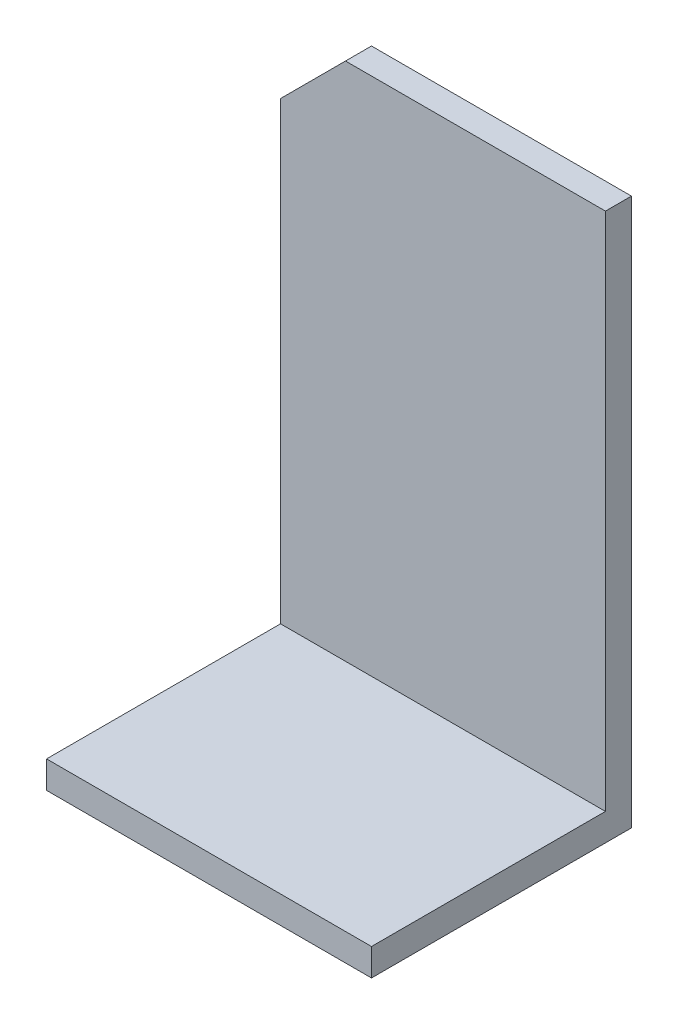
ISO-10303-21;
HEADER;
FILE_DESCRIPTION(('STEP AP214'),'2;1');
FILE_NAME('part.step','',(''),(''),'','','');
FILE_SCHEMA(('AUTOMOTIVE_DESIGN { 1 0 10303 214 1 1 1 1 }'));
ENDSEC;
DATA;
#1=APPLICATION_CONTEXT('core data for automotive mechanical design processes');
#2=APPLICATION_PROTOCOL_DEFINITION('international standard','automotive_design',2000,#1);
#3=PRODUCT_CONTEXT('',#1,'mechanical');
#4=PRODUCT('Part','Part','',(#3));
#5=PRODUCT_RELATED_PRODUCT_CATEGORY('part','',(#4));
#6=PRODUCT_DEFINITION_FORMATION('','',#4);
#7=PRODUCT_DEFINITION_CONTEXT('part definition',#1,'design');
#8=PRODUCT_DEFINITION('design','',#6,#7);
#9=PRODUCT_DEFINITION_SHAPE('','',#8);
#10=(LENGTH_UNIT() NAMED_UNIT(*) SI_UNIT(.MILLI.,.METRE.));
#11=(NAMED_UNIT(*) PLANE_ANGLE_UNIT() SI_UNIT($,.RADIAN.));
#12=(NAMED_UNIT(*) SI_UNIT($,.STERADIAN.) SOLID_ANGLE_UNIT());
#13=UNCERTAINTY_MEASURE_WITH_UNIT(LENGTH_MEASURE(1.E-05),#10,'distance_accuracy_value','');
#14=(GEOMETRIC_REPRESENTATION_CONTEXT(3) GLOBAL_UNCERTAINTY_ASSIGNED_CONTEXT((#13)) GLOBAL_UNIT_ASSIGNED_CONTEXT((#10,
#11,#12)) REPRESENTATION_CONTEXT('',''));
#15=CARTESIAN_POINT('',(0.,0.,0.));
#16=DIRECTION('',(0.,0.,1.));
#17=DIRECTION('',(1.,0.,0.));
#18=AXIS2_PLACEMENT_3D('',#15,#16,#17);
#19=CARTESIAN_POINT('',(-0.778320699595434,-1.5105,0.2));
#20=DIRECTION('',(0.,0.,1.));
#21=DIRECTION('',(0.,-1.,0.));
#22=AXIS2_PLACEMENT_3D('',#19,#20,#21);
#23=PLANE('',#22);
#24=DIRECTION('',(1.,0.,0.));
#25=VECTOR('',#24,1.);
#26=CARTESIAN_POINT('',(-0.778320699595434,-1.521,0.2));
#27=LINE('',#26,#25);
#28=CARTESIAN_POINT('',(-0.903320699595434,-1.521,0.2));
#29=VERTEX_POINT('',#28);
#30=CARTESIAN_POINT('',(-0.653320699595434,-1.521,0.2));
#31=VERTEX_POINT('',#30);
#32=EDGE_CURVE('E78',#29,#31,#27,.T.);
#33=ORIENTED_EDGE('',*,*,#32,.T.);
#34=DIRECTION('',(0.,-1.,0.));
#35=VECTOR('',#34,1.);
#36=CARTESIAN_POINT('',(-0.653320699595434,-1.36847101449276,0.2));
#37=LINE('',#36,#35);
#38=CARTESIAN_POINT('',(-0.653320699595434,-1.5,0.2));
#39=VERTEX_POINT('',#38);
#40=EDGE_CURVE('E113',#39,#31,#37,.T.);
#41=ORIENTED_EDGE('',*,*,#40,.F.);
#42=DIRECTION('',(1.,0.,0.));
#43=VECTOR('',#42,1.);
#44=CARTESIAN_POINT('',(-0.778320699595434,-1.5,0.2));
#45=LINE('',#44,#43);
#46=CARTESIAN_POINT('',(-0.903320699595434,-1.5,0.2));
#47=VERTEX_POINT('',#46);
#48=EDGE_CURVE('E11',#47,#39,#45,.T.);
#49=ORIENTED_EDGE('',*,*,#48,.F.);
#50=DIRECTION('',(0.,-1.,0.));
#51=VECTOR('',#50,1.);
#52=CARTESIAN_POINT('',(-0.903320699595434,-1.3906663747811,0.2));
#53=LINE('',#52,#51);
#54=EDGE_CURVE('E149',#47,#29,#53,.T.);
#55=ORIENTED_EDGE('',*,*,#54,.T.);
#56=EDGE_LOOP('',(#33,#41,#49,#55));
#57=FACE_BOUND('',#56,.T.);
#58=ADVANCED_FACE('F16',(#57),#23,.T.);
#59=CARTESIAN_POINT('',(-0.778320699595434,-1.5,0.11));
#60=DIRECTION('',(0.,1.,0.));
#61=DIRECTION('',(1.,0.,0.));
#62=AXIS2_PLACEMENT_3D('',#59,#60,#61);
#63=PLANE('',#62);
#64=DIRECTION('',(0.,0.,1.));
#65=VECTOR('',#64,1.);
#66=CARTESIAN_POINT('',(-0.903320699595434,-1.5,0.0448336252189149));
#67=LINE('',#66,#65);
#68=CARTESIAN_POINT('',(-0.903320699595434,-1.5,0.02));
#69=VERTEX_POINT('',#68);
#70=EDGE_CURVE('E152',#69,#47,#67,.T.);
#71=ORIENTED_EDGE('',*,*,#70,.T.);
#72=ORIENTED_EDGE('',*,*,#48,.T.);
#73=DIRECTION('',(0.,0.,1.));
#74=VECTOR('',#73,1.);
#75=CARTESIAN_POINT('',(-0.653320699595434,-1.5,0.0420289855072472));
#76=LINE('',#75,#74);
#77=CARTESIAN_POINT('',(-0.653320699595434,-1.5,0.02));
#78=VERTEX_POINT('',#77);
#79=EDGE_CURVE('E142',#78,#39,#76,.T.);
#80=ORIENTED_EDGE('',*,*,#79,.F.);
#81=DIRECTION('',(1.,0.,0.));
#82=VECTOR('',#81,1.);
#83=CARTESIAN_POINT('',(-0.775032042106288,-1.5,0.02));
#84=LINE('',#83,#82);
#85=EDGE_CURVE('E27',#69,#78,#84,.T.);
#86=ORIENTED_EDGE('',*,*,#85,.F.);
#87=EDGE_LOOP('',(#71,#72,#80,#86));
#88=FACE_BOUND('',#87,.T.);
#89=ADVANCED_FACE('F225',(#88),#63,.T.);
#90=CARTESIAN_POINT('',(-0.775032042106288,-1.3050173744811,0.02));
#91=DIRECTION('',(0.,0.,1.));
#92=DIRECTION('',(0.,-1.,0.));
#93=AXIS2_PLACEMENT_3D('',#90,#91,#92);
#94=PLANE('',#93);
#95=DIRECTION('',(-0.707106781186547,-0.707106781186548,0.));
#96=VECTOR('',#95,1.);
#97=CARTESIAN_POINT('',(-0.878320699595436,-1.12500000000002,0.02));
#98=LINE('',#97,#96);
#99=CARTESIAN_POINT('',(-0.853320699595434,-1.10000000000002,0.02));
#100=VERTEX_POINT('',#99);
#101=CARTESIAN_POINT('',(-0.903320699595434,-1.15000000000002,0.02));
#102=VERTEX_POINT('',#101);
#103=EDGE_CURVE('E42',#100,#102,#98,.T.);
#104=ORIENTED_EDGE('',*,*,#103,.T.);
#105=DIRECTION('',(0.,-1.,0.));
#106=VECTOR('',#105,1.);
#107=CARTESIAN_POINT('',(-0.903320699595434,-1.3906663747811,0.02));
#108=LINE('',#107,#106);
#109=EDGE_CURVE('E20',#102,#69,#108,.T.);
#110=ORIENTED_EDGE('',*,*,#109,.T.);
#111=ORIENTED_EDGE('',*,*,#85,.T.);
#112=DIRECTION('',(0.,-1.,0.));
#113=VECTOR('',#112,1.);
#114=CARTESIAN_POINT('',(-0.653320699595434,-1.36847101449276,0.02));
#115=LINE('',#114,#113);
#116=CARTESIAN_POINT('',(-0.653320699595434,-1.10000000000002,0.02));
#117=VERTEX_POINT('',#116);
#118=EDGE_CURVE('E144',#117,#78,#115,.T.);
#119=ORIENTED_EDGE('',*,*,#118,.F.);
#120=DIRECTION('',(1.,0.,0.));
#121=VECTOR('',#120,1.);
#122=CARTESIAN_POINT('',(-0.753320699595435,-1.10000000000002,0.02));
#123=LINE('',#122,#121);
#124=EDGE_CURVE('E159',#100,#117,#123,.T.);
#125=ORIENTED_EDGE('',*,*,#124,.F.);
#126=EDGE_LOOP('',(#104,#110,#111,#119,#125));
#127=FACE_BOUND('',#126,.T.);
#128=ADVANCED_FACE('F18',(#127),#94,.T.);
#129=CARTESIAN_POINT('',(-0.878320699595436,-1.12500000000002,0.01));
#130=DIRECTION('',(0.707106781186548,-0.707106781186547,0.));
#131=DIRECTION('',(0.,0.,-1.));
#132=AXIS2_PLACEMENT_3D('',#129,#130,#131);
#133=PLANE('',#132);
#134=DIRECTION('',(0.,0.,1.));
#135=VECTOR('',#134,1.);
#136=CARTESIAN_POINT('',(-0.903320699595434,-1.15000000000002,0.0448336252189149));
#137=LINE('',#136,#135);
#138=CARTESIAN_POINT('',(-0.903320699595434,-1.15000000000002,0.));
#139=VERTEX_POINT('',#138);
#140=EDGE_CURVE('E176',#139,#102,#137,.T.);
#141=ORIENTED_EDGE('',*,*,#140,.T.);
#142=ORIENTED_EDGE('',*,*,#103,.F.);
#143=DIRECTION('',(0.,0.,1.));
#144=VECTOR('',#143,1.);
#145=CARTESIAN_POINT('',(-0.853320699595434,-1.10000000000002,0.01));
#146=LINE('',#145,#144);
#147=CARTESIAN_POINT('',(-0.853320699595434,-1.10000000000002,0.));
#148=VERTEX_POINT('',#147);
#149=EDGE_CURVE('E162',#148,#100,#146,.T.);
#150=ORIENTED_EDGE('',*,*,#149,.F.);
#151=DIRECTION('',(-0.707106781186545,-0.70710678118655,0.));
#152=VECTOR('',#151,1.);
#153=CARTESIAN_POINT('',(-0.853320699595434,-1.10000000000002,0.));
#154=LINE('',#153,#152);
#155=EDGE_CURVE('E145',#148,#139,#154,.T.);
#156=ORIENTED_EDGE('',*,*,#155,.T.);
#157=EDGE_LOOP('',(#141,#142,#150,#156));
#158=FACE_BOUND('',#157,.T.);
#159=ADVANCED_FACE('F213',(#158),#133,.F.);
#160=CARTESIAN_POINT('',(-0.903320699595434,-1.3906663747811,0.0448336252189149));
#161=DIRECTION('',(1.,0.,0.));
#162=DIRECTION('',(0.,-1.,0.));
#163=AXIS2_PLACEMENT_3D('',#160,#161,#162);
#164=PLANE('',#163);
#165=DIRECTION('',(0.,0.,1.));
#166=VECTOR('',#165,1.);
#167=CARTESIAN_POINT('',(-0.903320699595434,-1.521,0.0999999999999988));
#168=LINE('',#167,#166);
#169=CARTESIAN_POINT('',(-0.903320699595434,-1.521,0.));
#170=VERTEX_POINT('',#169);
#171=EDGE_CURVE('E121',#170,#29,#168,.T.);
#172=ORIENTED_EDGE('',*,*,#171,.T.);
#173=ORIENTED_EDGE('',*,*,#54,.F.);
#174=ORIENTED_EDGE('',*,*,#70,.F.);
#175=ORIENTED_EDGE('',*,*,#109,.F.);
#176=ORIENTED_EDGE('',*,*,#140,.F.);
#177=DIRECTION('',(0.,-1.,0.));
#178=VECTOR('',#177,1.);
#179=CARTESIAN_POINT('',(-0.903320699595434,-1.31559112123517,0.));
#180=LINE('',#179,#178);
#181=EDGE_CURVE('E126',#139,#170,#180,.T.);
#182=ORIENTED_EDGE('',*,*,#181,.T.);
#183=EDGE_LOOP('',(#172,#173,#174,#175,#176,#182));
#184=FACE_BOUND('',#183,.T.);
#185=ADVANCED_FACE('F183',(#184),#164,.F.);
#186=CARTESIAN_POINT('',(-0.778320699595434,-1.521,0.0999999999999988));
#187=DIRECTION('',(0.,1.,0.));
#188=DIRECTION('',(1.,0.,0.));
#189=AXIS2_PLACEMENT_3D('',#186,#187,#188);
#190=PLANE('',#189);
#191=DIRECTION('',(1.,0.,0.));
#192=VECTOR('',#191,1.);
#193=CARTESIAN_POINT('',(-0.775137262256353,-1.521,0.));
#194=LINE('',#193,#192);
#195=CARTESIAN_POINT('',(-0.653320699595434,-1.521,0.));
#196=VERTEX_POINT('',#195);
#197=EDGE_CURVE('E118',#170,#196,#194,.T.);
#198=ORIENTED_EDGE('',*,*,#197,.T.);
#199=DIRECTION('',(0.,0.,-1.));
#200=VECTOR('',#199,1.);
#201=CARTESIAN_POINT('',(-0.653320699595434,-1.521,0.0420289855072472));
#202=LINE('',#201,#200);
#203=EDGE_CURVE('E105',#31,#196,#202,.T.);
#204=ORIENTED_EDGE('',*,*,#203,.F.);
#205=ORIENTED_EDGE('',*,*,#32,.F.);
#206=ORIENTED_EDGE('',*,*,#171,.F.);
#207=EDGE_LOOP('',(#198,#204,#205,#206));
#208=FACE_BOUND('',#207,.T.);
#209=ADVANCED_FACE('F119',(#208),#190,.F.);
#210=CARTESIAN_POINT('',(-0.653320699595434,-1.36847101449276,0.0420289855072472));
#211=DIRECTION('',(1.,0.,0.));
#212=DIRECTION('',(0.,-1.,0.));
#213=AXIS2_PLACEMENT_3D('',#210,#211,#212);
#214=PLANE('',#213);
#215=ORIENTED_EDGE('',*,*,#118,.T.);
#216=ORIENTED_EDGE('',*,*,#79,.T.);
#217=ORIENTED_EDGE('',*,*,#40,.T.);
#218=ORIENTED_EDGE('',*,*,#203,.T.);
#219=DIRECTION('',(0.,1.,0.));
#220=VECTOR('',#219,1.);
#221=CARTESIAN_POINT('',(-0.653320699595434,-1.31559112123517,0.));
#222=LINE('',#221,#220);
#223=CARTESIAN_POINT('',(-0.653320699595434,-1.10000000000002,0.));
#224=VERTEX_POINT('',#223);
#225=EDGE_CURVE('E111',#196,#224,#222,.T.);
#226=ORIENTED_EDGE('',*,*,#225,.T.);
#227=DIRECTION('',(0.,0.,-1.));
#228=VECTOR('',#227,1.);
#229=CARTESIAN_POINT('',(-0.653320699595434,-1.10000000000002,0.01));
#230=LINE('',#229,#228);
#231=EDGE_CURVE('E397',#117,#224,#230,.T.);
#232=ORIENTED_EDGE('',*,*,#231,.F.);
#233=EDGE_LOOP('',(#215,#216,#217,#218,#226,#232));
#234=FACE_BOUND('',#233,.T.);
#235=ADVANCED_FACE('F108',(#234),#214,.T.);
#236=CARTESIAN_POINT('',(-0.753320699595435,-1.10000000000002,0.01));
#237=DIRECTION('',(0.,1.,0.));
#238=DIRECTION('',(0.,0.,-1.));
#239=AXIS2_PLACEMENT_3D('',#236,#237,#238);
#240=PLANE('',#239);
#241=ORIENTED_EDGE('',*,*,#231,.T.);
#242=DIRECTION('',(-1.,0.,0.));
#243=VECTOR('',#242,1.);
#244=CARTESIAN_POINT('',(-0.775137262256353,-1.10000000000002,0.));
#245=LINE('',#244,#243);
#246=EDGE_CURVE('E132',#224,#148,#245,.T.);
#247=ORIENTED_EDGE('',*,*,#246,.T.);
#248=ORIENTED_EDGE('',*,*,#149,.T.);
#249=ORIENTED_EDGE('',*,*,#124,.T.);
#250=EDGE_LOOP('',(#241,#247,#248,#249));
#251=FACE_BOUND('',#250,.T.);
#252=ADVANCED_FACE('F195',(#251),#240,.T.);
#253=CARTESIAN_POINT('',(-0.775137262256353,-1.31559112123517,0.));
#254=DIRECTION('',(0.,0.,1.));
#255=DIRECTION('',(0.,-1.,0.));
#256=AXIS2_PLACEMENT_3D('',#253,#254,#255);
#257=PLANE('',#256);
#258=ORIENTED_EDGE('',*,*,#225,.F.);
#259=ORIENTED_EDGE('',*,*,#197,.F.);
#260=ORIENTED_EDGE('',*,*,#181,.F.);
#261=ORIENTED_EDGE('',*,*,#155,.F.);
#262=ORIENTED_EDGE('',*,*,#246,.F.);
#263=EDGE_LOOP('',(#258,#259,#260,#261,#262));
#264=FACE_BOUND('',#263,.T.);
#265=ADVANCED_FACE('F129',(#264),#257,.F.);
#266=CLOSED_SHELL('',(#58,#89,#128,#159,#185,#209,#235,#252,#265));
#267=MANIFOLD_SOLID_BREP('B1',#266);
#268=ADVANCED_BREP_SHAPE_REPRESENTATION('',(#18,#267),#14);
#269=SHAPE_DEFINITION_REPRESENTATION(#9,#268);
ENDSEC;
END-ISO-10303-21;
